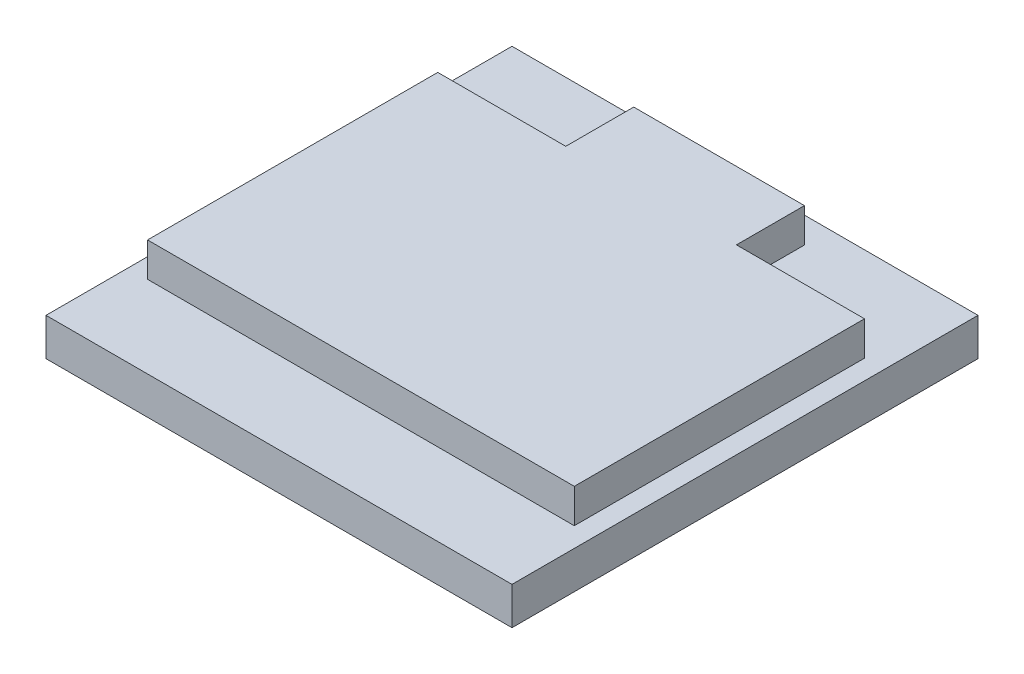
ISO-10303-21;
HEADER;
FILE_DESCRIPTION(('STEP AP214'),'2;1');
FILE_NAME('part.step','',(''),(''),'','','');
FILE_SCHEMA(('AUTOMOTIVE_DESIGN { 1 0 10303 214 1 1 1 1 }'));
ENDSEC;
DATA;
#1=APPLICATION_CONTEXT('core data for automotive mechanical design processes');
#2=APPLICATION_PROTOCOL_DEFINITION('international standard','automotive_design',2000,#1);
#3=PRODUCT_CONTEXT('',#1,'mechanical');
#4=PRODUCT('Part','Part','',(#3));
#5=PRODUCT_RELATED_PRODUCT_CATEGORY('part','',(#4));
#6=PRODUCT_DEFINITION_FORMATION('','',#4);
#7=PRODUCT_DEFINITION_CONTEXT('part definition',#1,'design');
#8=PRODUCT_DEFINITION('design','',#6,#7);
#9=PRODUCT_DEFINITION_SHAPE('','',#8);
#10=(LENGTH_UNIT() NAMED_UNIT(*) SI_UNIT(.MILLI.,.METRE.));
#11=(NAMED_UNIT(*) PLANE_ANGLE_UNIT() SI_UNIT($,.RADIAN.));
#12=(NAMED_UNIT(*) SI_UNIT($,.STERADIAN.) SOLID_ANGLE_UNIT());
#13=UNCERTAINTY_MEASURE_WITH_UNIT(LENGTH_MEASURE(1.E-05),#10,'distance_accuracy_value','');
#14=(GEOMETRIC_REPRESENTATION_CONTEXT(3) GLOBAL_UNCERTAINTY_ASSIGNED_CONTEXT((#13)) GLOBAL_UNIT_ASSIGNED_CONTEXT((#10,
#11,#12)) REPRESENTATION_CONTEXT('',''));
#15=CARTESIAN_POINT('',(0.,0.,0.));
#16=DIRECTION('',(0.,0.,1.));
#17=DIRECTION('',(1.,0.,0.));
#18=AXIS2_PLACEMENT_3D('',#15,#16,#17);
#19=CARTESIAN_POINT('',(13.65,2.2,13.65));
#20=DIRECTION('',(-1.,0.,0.));
#21=DIRECTION('',(0.,0.,1.));
#22=AXIS2_PLACEMENT_3D('',#19,#20,#21);
#23=PLANE('',#22);
#24=DIRECTION('',(0.,0.,-1.));
#25=VECTOR('',#24,1.);
#26=CARTESIAN_POINT('',(13.65,0.,13.65));
#27=LINE('',#26,#25);
#28=CARTESIAN_POINT('',(13.65,0.,13.65));
#29=VERTEX_POINT('',#28);
#30=CARTESIAN_POINT('',(13.65,0.,-13.65));
#31=VERTEX_POINT('',#30);
#32=EDGE_CURVE('E129',#29,#31,#27,.T.);
#33=ORIENTED_EDGE('',*,*,#32,.T.);
#34=DIRECTION('',(0.,-1.,0.));
#35=VECTOR('',#34,1.);
#36=CARTESIAN_POINT('',(13.65,2.2,-13.65));
#37=LINE('',#36,#35);
#38=CARTESIAN_POINT('',(13.65,2.2,-13.65));
#39=VERTEX_POINT('',#38);
#40=EDGE_CURVE('E11',#39,#31,#37,.T.);
#41=ORIENTED_EDGE('',*,*,#40,.F.);
#42=DIRECTION('',(0.,0.,-1.));
#43=VECTOR('',#42,1.);
#44=CARTESIAN_POINT('',(13.65,2.2,13.65));
#45=LINE('',#44,#43);
#46=CARTESIAN_POINT('',(13.65,2.2,13.65));
#47=VERTEX_POINT('',#46);
#48=EDGE_CURVE('E194',#47,#39,#45,.T.);
#49=ORIENTED_EDGE('',*,*,#48,.F.);
#50=DIRECTION('',(0.,-1.,0.));
#51=VECTOR('',#50,1.);
#52=CARTESIAN_POINT('',(13.65,2.2,13.65));
#53=LINE('',#52,#51);
#54=EDGE_CURVE('E204',#47,#29,#53,.T.);
#55=ORIENTED_EDGE('',*,*,#54,.T.);
#56=EDGE_LOOP('',(#33,#41,#49,#55));
#57=FACE_BOUND('',#56,.T.);
#58=ADVANCED_FACE('F35',(#57),#23,.F.);
#59=CARTESIAN_POINT('',(-13.65,2.2,-13.65));
#60=DIRECTION('',(0.,0.,1.));
#61=DIRECTION('',(1.,0.,0.));
#62=AXIS2_PLACEMENT_3D('',#59,#60,#61);
#63=PLANE('',#62);
#64=DIRECTION('',(-1.,0.,0.));
#65=VECTOR('',#64,1.);
#66=CARTESIAN_POINT('',(-13.65,0.,-13.65));
#67=LINE('',#66,#65);
#68=CARTESIAN_POINT('',(-13.65,0.,-13.65));
#69=VERTEX_POINT('',#68);
#70=EDGE_CURVE('E207',#31,#69,#67,.T.);
#71=ORIENTED_EDGE('',*,*,#70,.T.);
#72=DIRECTION('',(0.,-1.,0.));
#73=VECTOR('',#72,1.);
#74=CARTESIAN_POINT('',(-13.65,2.2,-13.65));
#75=LINE('',#74,#73);
#76=CARTESIAN_POINT('',(-13.65,2.2,-13.65));
#77=VERTEX_POINT('',#76);
#78=EDGE_CURVE('E42',#77,#69,#75,.T.);
#79=ORIENTED_EDGE('',*,*,#78,.F.);
#80=DIRECTION('',(-1.,0.,0.));
#81=VECTOR('',#80,1.);
#82=CARTESIAN_POINT('',(-13.65,2.2,-13.65));
#83=LINE('',#82,#81);
#84=EDGE_CURVE('E197',#39,#77,#83,.T.);
#85=ORIENTED_EDGE('',*,*,#84,.F.);
#86=ORIENTED_EDGE('',*,*,#40,.T.);
#87=EDGE_LOOP('',(#71,#79,#85,#86));
#88=FACE_BOUND('',#87,.T.);
#89=ADVANCED_FACE('F237',(#88),#63,.F.);
#90=CARTESIAN_POINT('',(-13.65,2.2,13.65));
#91=DIRECTION('',(1.,0.,0.));
#92=DIRECTION('',(0.,0.,-1.));
#93=AXIS2_PLACEMENT_3D('',#90,#91,#92);
#94=PLANE('',#93);
#95=DIRECTION('',(0.,0.,1.));
#96=VECTOR('',#95,1.);
#97=CARTESIAN_POINT('',(-13.65,0.,13.65));
#98=LINE('',#97,#96);
#99=CARTESIAN_POINT('',(-13.65,0.,13.65));
#100=VERTEX_POINT('',#99);
#101=EDGE_CURVE('E209',#69,#100,#98,.T.);
#102=ORIENTED_EDGE('',*,*,#101,.T.);
#103=DIRECTION('',(0.,-1.,0.));
#104=VECTOR('',#103,1.);
#105=CARTESIAN_POINT('',(-13.65,2.2,13.65));
#106=LINE('',#105,#104);
#107=CARTESIAN_POINT('',(-13.65,2.2,13.65));
#108=VERTEX_POINT('',#107);
#109=EDGE_CURVE('E214',#108,#100,#106,.T.);
#110=ORIENTED_EDGE('',*,*,#109,.F.);
#111=DIRECTION('',(0.,0.,1.));
#112=VECTOR('',#111,1.);
#113=CARTESIAN_POINT('',(-13.65,2.2,13.65));
#114=LINE('',#113,#112);
#115=EDGE_CURVE('E200',#77,#108,#114,.T.);
#116=ORIENTED_EDGE('',*,*,#115,.F.);
#117=ORIENTED_EDGE('',*,*,#78,.T.);
#118=EDGE_LOOP('',(#102,#110,#116,#117));
#119=FACE_BOUND('',#118,.T.);
#120=ADVANCED_FACE('F221',(#119),#94,.F.);
#121=CARTESIAN_POINT('',(-13.65,2.2,13.65));
#122=DIRECTION('',(0.,0.,-1.));
#123=DIRECTION('',(-1.,0.,0.));
#124=AXIS2_PLACEMENT_3D('',#121,#122,#123);
#125=PLANE('',#124);
#126=DIRECTION('',(1.,0.,0.));
#127=VECTOR('',#126,1.);
#128=CARTESIAN_POINT('',(-13.65,0.,13.65));
#129=LINE('',#128,#127);
#130=EDGE_CURVE('E198',#100,#29,#129,.T.);
#131=ORIENTED_EDGE('',*,*,#130,.T.);
#132=ORIENTED_EDGE('',*,*,#54,.F.);
#133=DIRECTION('',(1.,0.,0.));
#134=VECTOR('',#133,1.);
#135=CARTESIAN_POINT('',(-13.65,2.2,13.65));
#136=LINE('',#135,#134);
#137=EDGE_CURVE('E202',#108,#47,#136,.T.);
#138=ORIENTED_EDGE('',*,*,#137,.F.);
#139=ORIENTED_EDGE('',*,*,#109,.T.);
#140=EDGE_LOOP('',(#131,#132,#138,#139));
#141=FACE_BOUND('',#140,.T.);
#142=ADVANCED_FACE('F230',(#141),#125,.F.);
#143=CARTESIAN_POINT('',(0.,2.2,0.));
#144=DIRECTION('',(0.,-1.,0.));
#145=DIRECTION('',(0.,0.,-1.));
#146=AXIS2_PLACEMENT_3D('',#143,#144,#145);
#147=PLANE('',#146);
#148=DIRECTION('',(0.,0.,-1.));
#149=VECTOR('',#148,1.);
#150=CARTESIAN_POINT('',(5.,2.2,0.));
#151=LINE('',#150,#149);
#152=CARTESIAN_POINT('',(5.,2.2,-8.15));
#153=VERTEX_POINT('',#152);
#154=CARTESIAN_POINT('',(5.,2.2,-12.1321184583191));
#155=VERTEX_POINT('',#154);
#156=EDGE_CURVE('E169',#153,#155,#151,.T.);
#157=ORIENTED_EDGE('',*,*,#156,.F.);
#158=DIRECTION('',(1.,0.,0.));
#159=VECTOR('',#158,1.);
#160=CARTESIAN_POINT('',(0.,2.2,-8.15));
#161=LINE('',#160,#159);
#162=CARTESIAN_POINT('',(12.5,2.2,-8.15));
#163=VERTEX_POINT('',#162);
#164=EDGE_CURVE('E49',#153,#163,#161,.T.);
#165=ORIENTED_EDGE('',*,*,#164,.T.);
#166=DIRECTION('',(0.,0.,-1.));
#167=VECTOR('',#166,1.);
#168=CARTESIAN_POINT('',(12.5,2.2,0.));
#169=LINE('',#168,#167);
#170=CARTESIAN_POINT('',(12.5,2.2,8.85));
#171=VERTEX_POINT('',#170);
#172=EDGE_CURVE('E54',#171,#163,#169,.T.);
#173=ORIENTED_EDGE('',*,*,#172,.F.);
#174=DIRECTION('',(1.,0.,0.));
#175=VECTOR('',#174,1.);
#176=CARTESIAN_POINT('',(0.,2.2,8.85));
#177=LINE('',#176,#175);
#178=CARTESIAN_POINT('',(-12.5,2.2,8.85));
#179=VERTEX_POINT('',#178);
#180=EDGE_CURVE('E147',#179,#171,#177,.T.);
#181=ORIENTED_EDGE('',*,*,#180,.F.);
#182=DIRECTION('',(0.,0.,-1.));
#183=VECTOR('',#182,1.);
#184=CARTESIAN_POINT('',(-12.5,2.2,0.));
#185=LINE('',#184,#183);
#186=CARTESIAN_POINT('',(-12.5,2.2,-8.15));
#187=VERTEX_POINT('',#186);
#188=EDGE_CURVE('E176',#179,#187,#185,.T.);
#189=ORIENTED_EDGE('',*,*,#188,.T.);
#190=CARTESIAN_POINT('',(-5.,2.2,-8.15));
#191=VERTEX_POINT('',#190);
#192=EDGE_CURVE('E170',#187,#191,#161,.T.);
#193=ORIENTED_EDGE('',*,*,#192,.T.);
#194=DIRECTION('',(0.,0.,-1.));
#195=VECTOR('',#194,1.);
#196=CARTESIAN_POINT('',(-5.,2.2,0.));
#197=LINE('',#196,#195);
#198=CARTESIAN_POINT('',(-5.,2.2,-12.1321184583191));
#199=VERTEX_POINT('',#198);
#200=EDGE_CURVE('E174',#191,#199,#197,.T.);
#201=ORIENTED_EDGE('',*,*,#200,.T.);
#202=DIRECTION('',(1.,0.,0.));
#203=VECTOR('',#202,1.);
#204=CARTESIAN_POINT('',(0.,2.2,-12.1321184583191));
#205=LINE('',#204,#203);
#206=EDGE_CURVE('E172',#199,#155,#205,.T.);
#207=ORIENTED_EDGE('',*,*,#206,.T.);
#208=EDGE_LOOP('',(#157,#165,#173,#181,#189,#193,#201,#207));
#209=FACE_BOUND('',#208,.T.);
#210=ORIENTED_EDGE('',*,*,#48,.T.);
#211=ORIENTED_EDGE('',*,*,#84,.T.);
#212=ORIENTED_EDGE('',*,*,#115,.T.);
#213=ORIENTED_EDGE('',*,*,#137,.T.);
#214=EDGE_LOOP('',(#210,#211,#212,#213));
#215=FACE_BOUND('',#214,.T.);
#216=ADVANCED_FACE('F236',(#209,#215),#147,.F.);
#217=CARTESIAN_POINT('',(0.,0.,0.));
#218=DIRECTION('',(0.,-1.,0.));
#219=DIRECTION('',(0.,0.,-1.));
#220=AXIS2_PLACEMENT_3D('',#217,#218,#219);
#221=PLANE('',#220);
#222=ORIENTED_EDGE('',*,*,#32,.F.);
#223=ORIENTED_EDGE('',*,*,#130,.F.);
#224=ORIENTED_EDGE('',*,*,#101,.F.);
#225=ORIENTED_EDGE('',*,*,#70,.F.);
#226=EDGE_LOOP('',(#222,#223,#224,#225));
#227=FACE_BOUND('',#226,.T.);
#228=ADVANCED_FACE('F227',(#227),#221,.T.);
#229=CARTESIAN_POINT('',(0.,4.2,-8.15));
#230=DIRECTION('',(0.,0.,-1.));
#231=DIRECTION('',(-1.,0.,0.));
#232=AXIS2_PLACEMENT_3D('',#229,#230,#231);
#233=PLANE('',#232);
#234=ORIENTED_EDGE('',*,*,#164,.F.);
#235=DIRECTION('',(0.,-1.,0.));
#236=VECTOR('',#235,1.);
#237=CARTESIAN_POINT('',(5.,4.2,-8.15));
#238=LINE('',#237,#236);
#239=CARTESIAN_POINT('',(5.,4.2,-8.15));
#240=VERTEX_POINT('',#239);
#241=EDGE_CURVE('E122',#240,#153,#238,.T.);
#242=ORIENTED_EDGE('',*,*,#241,.F.);
#243=DIRECTION('',(1.,0.,0.));
#244=VECTOR('',#243,1.);
#245=CARTESIAN_POINT('',(0.,4.2,-8.15));
#246=LINE('',#245,#244);
#247=CARTESIAN_POINT('',(12.5,4.2,-8.15));
#248=VERTEX_POINT('',#247);
#249=EDGE_CURVE('E126',#240,#248,#246,.T.);
#250=ORIENTED_EDGE('',*,*,#249,.T.);
#251=DIRECTION('',(0.,-1.,0.));
#252=VECTOR('',#251,1.);
#253=CARTESIAN_POINT('',(12.5,4.2,-8.15));
#254=LINE('',#253,#252);
#255=EDGE_CURVE('E167',#248,#163,#254,.T.);
#256=ORIENTED_EDGE('',*,*,#255,.T.);
#257=EDGE_LOOP('',(#234,#242,#250,#256));
#258=FACE_BOUND('',#257,.T.);
#259=ADVANCED_FACE('F124',(#258),#233,.T.);
#260=CARTESIAN_POINT('',(5.,4.2,0.));
#261=DIRECTION('',(-1.,0.,0.));
#262=DIRECTION('',(0.,0.,1.));
#263=AXIS2_PLACEMENT_3D('',#260,#261,#262);
#264=PLANE('',#263);
#265=ORIENTED_EDGE('',*,*,#156,.T.);
#266=DIRECTION('',(0.,-1.,0.));
#267=VECTOR('',#266,1.);
#268=CARTESIAN_POINT('',(5.,4.2,-12.1321184583191));
#269=LINE('',#268,#267);
#270=CARTESIAN_POINT('',(5.,4.2,-12.1321184583191));
#271=VERTEX_POINT('',#270);
#272=EDGE_CURVE('E130',#271,#155,#269,.T.);
#273=ORIENTED_EDGE('',*,*,#272,.F.);
#274=DIRECTION('',(0.,0.,-1.));
#275=VECTOR('',#274,1.);
#276=CARTESIAN_POINT('',(5.,4.2,0.));
#277=LINE('',#276,#275);
#278=EDGE_CURVE('E133',#240,#271,#277,.T.);
#279=ORIENTED_EDGE('',*,*,#278,.F.);
#280=ORIENTED_EDGE('',*,*,#241,.T.);
#281=EDGE_LOOP('',(#265,#273,#279,#280));
#282=FACE_BOUND('',#281,.T.);
#283=ADVANCED_FACE('F134',(#282),#264,.F.);
#284=CARTESIAN_POINT('',(0.,4.2,-12.1321184583191));
#285=DIRECTION('',(0.,0.,-1.));
#286=DIRECTION('',(-1.,0.,0.));
#287=AXIS2_PLACEMENT_3D('',#284,#285,#286);
#288=PLANE('',#287);
#289=ORIENTED_EDGE('',*,*,#206,.F.);
#290=DIRECTION('',(0.,-1.,0.));
#291=VECTOR('',#290,1.);
#292=CARTESIAN_POINT('',(-5.,4.2,-12.1321184583191));
#293=LINE('',#292,#291);
#294=CARTESIAN_POINT('',(-5.,4.2,-12.1321184583191));
#295=VERTEX_POINT('',#294);
#296=EDGE_CURVE('E191',#295,#199,#293,.T.);
#297=ORIENTED_EDGE('',*,*,#296,.F.);
#298=DIRECTION('',(1.,0.,0.));
#299=VECTOR('',#298,1.);
#300=CARTESIAN_POINT('',(0.,4.2,-12.1321184583191));
#301=LINE('',#300,#299);
#302=EDGE_CURVE('E139',#295,#271,#301,.T.);
#303=ORIENTED_EDGE('',*,*,#302,.T.);
#304=ORIENTED_EDGE('',*,*,#272,.T.);
#305=EDGE_LOOP('',(#289,#297,#303,#304));
#306=FACE_BOUND('',#305,.T.);
#307=ADVANCED_FACE('F253',(#306),#288,.T.);
#308=CARTESIAN_POINT('',(-5.,4.2,0.));
#309=DIRECTION('',(-1.,0.,0.));
#310=DIRECTION('',(0.,0.,1.));
#311=AXIS2_PLACEMENT_3D('',#308,#309,#310);
#312=PLANE('',#311);
#313=ORIENTED_EDGE('',*,*,#200,.F.);
#314=DIRECTION('',(0.,-1.,0.));
#315=VECTOR('',#314,1.);
#316=CARTESIAN_POINT('',(-5.,4.2,-8.15));
#317=LINE('',#316,#315);
#318=CARTESIAN_POINT('',(-5.,4.2,-8.15));
#319=VERTEX_POINT('',#318);
#320=EDGE_CURVE('E189',#319,#191,#317,.T.);
#321=ORIENTED_EDGE('',*,*,#320,.F.);
#322=DIRECTION('',(0.,0.,-1.));
#323=VECTOR('',#322,1.);
#324=CARTESIAN_POINT('',(-5.,4.2,0.));
#325=LINE('',#324,#323);
#326=EDGE_CURVE('E151',#319,#295,#325,.T.);
#327=ORIENTED_EDGE('',*,*,#326,.T.);
#328=ORIENTED_EDGE('',*,*,#296,.T.);
#329=EDGE_LOOP('',(#313,#321,#327,#328));
#330=FACE_BOUND('',#329,.T.);
#331=ADVANCED_FACE('F256',(#330),#312,.T.);
#332=ORIENTED_EDGE('',*,*,#192,.F.);
#333=DIRECTION('',(0.,-1.,0.));
#334=VECTOR('',#333,1.);
#335=CARTESIAN_POINT('',(-12.5,4.2,-8.15));
#336=LINE('',#335,#334);
#337=CARTESIAN_POINT('',(-12.5,4.2,-8.15));
#338=VERTEX_POINT('',#337);
#339=EDGE_CURVE('E186',#338,#187,#336,.T.);
#340=ORIENTED_EDGE('',*,*,#339,.F.);
#341=EDGE_CURVE('E146',#338,#319,#246,.T.);
#342=ORIENTED_EDGE('',*,*,#341,.T.);
#343=ORIENTED_EDGE('',*,*,#320,.T.);
#344=EDGE_LOOP('',(#332,#340,#342,#343));
#345=FACE_BOUND('',#344,.T.);
#346=ADVANCED_FACE('F260',(#345),#233,.T.);
#347=CARTESIAN_POINT('',(-12.5,4.2,0.));
#348=DIRECTION('',(-1.,0.,0.));
#349=DIRECTION('',(0.,0.,1.));
#350=AXIS2_PLACEMENT_3D('',#347,#348,#349);
#351=PLANE('',#350);
#352=ORIENTED_EDGE('',*,*,#188,.F.);
#353=DIRECTION('',(0.,-1.,0.));
#354=VECTOR('',#353,1.);
#355=CARTESIAN_POINT('',(-12.5,4.2,8.85));
#356=LINE('',#355,#354);
#357=CARTESIAN_POINT('',(-12.5,4.2,8.85));
#358=VERTEX_POINT('',#357);
#359=EDGE_CURVE('E183',#358,#179,#356,.T.);
#360=ORIENTED_EDGE('',*,*,#359,.F.);
#361=DIRECTION('',(0.,0.,-1.));
#362=VECTOR('',#361,1.);
#363=CARTESIAN_POINT('',(-12.5,4.2,0.));
#364=LINE('',#363,#362);
#365=EDGE_CURVE('E150',#358,#338,#364,.T.);
#366=ORIENTED_EDGE('',*,*,#365,.T.);
#367=ORIENTED_EDGE('',*,*,#339,.T.);
#368=EDGE_LOOP('',(#352,#360,#366,#367));
#369=FACE_BOUND('',#368,.T.);
#370=ADVANCED_FACE('F263',(#369),#351,.T.);
#371=CARTESIAN_POINT('',(0.,4.2,8.85));
#372=DIRECTION('',(0.,0.,-1.));
#373=DIRECTION('',(-1.,0.,0.));
#374=AXIS2_PLACEMENT_3D('',#371,#372,#373);
#375=PLANE('',#374);
#376=ORIENTED_EDGE('',*,*,#180,.T.);
#377=DIRECTION('',(0.,-1.,0.));
#378=VECTOR('',#377,1.);
#379=CARTESIAN_POINT('',(12.5,4.2,8.85));
#380=LINE('',#379,#378);
#381=CARTESIAN_POINT('',(12.5,4.2,8.85));
#382=VERTEX_POINT('',#381);
#383=EDGE_CURVE('E180',#382,#171,#380,.T.);
#384=ORIENTED_EDGE('',*,*,#383,.F.);
#385=DIRECTION('',(1.,0.,0.));
#386=VECTOR('',#385,1.);
#387=CARTESIAN_POINT('',(0.,4.2,8.85));
#388=LINE('',#387,#386);
#389=EDGE_CURVE('E156',#358,#382,#388,.T.);
#390=ORIENTED_EDGE('',*,*,#389,.F.);
#391=ORIENTED_EDGE('',*,*,#359,.T.);
#392=EDGE_LOOP('',(#376,#384,#390,#391));
#393=FACE_BOUND('',#392,.T.);
#394=ADVANCED_FACE('F266',(#393),#375,.F.);
#395=CARTESIAN_POINT('',(12.5,4.2,0.));
#396=DIRECTION('',(-1.,0.,0.));
#397=DIRECTION('',(0.,0.,1.));
#398=AXIS2_PLACEMENT_3D('',#395,#396,#397);
#399=PLANE('',#398);
#400=ORIENTED_EDGE('',*,*,#172,.T.);
#401=ORIENTED_EDGE('',*,*,#255,.F.);
#402=DIRECTION('',(0.,0.,-1.));
#403=VECTOR('',#402,1.);
#404=CARTESIAN_POINT('',(12.5,4.2,0.));
#405=LINE('',#404,#403);
#406=EDGE_CURVE('E143',#382,#248,#405,.T.);
#407=ORIENTED_EDGE('',*,*,#406,.F.);
#408=ORIENTED_EDGE('',*,*,#383,.T.);
#409=EDGE_LOOP('',(#400,#401,#407,#408));
#410=FACE_BOUND('',#409,.T.);
#411=ADVANCED_FACE('F270',(#410),#399,.F.);
#412=CARTESIAN_POINT('',(0.,4.2,0.));
#413=DIRECTION('',(0.,1.,0.));
#414=DIRECTION('',(0.,0.,1.));
#415=AXIS2_PLACEMENT_3D('',#412,#413,#414);
#416=PLANE('',#415);
#417=ORIENTED_EDGE('',*,*,#249,.F.);
#418=ORIENTED_EDGE('',*,*,#278,.T.);
#419=ORIENTED_EDGE('',*,*,#302,.F.);
#420=ORIENTED_EDGE('',*,*,#326,.F.);
#421=ORIENTED_EDGE('',*,*,#341,.F.);
#422=ORIENTED_EDGE('',*,*,#365,.F.);
#423=ORIENTED_EDGE('',*,*,#389,.T.);
#424=ORIENTED_EDGE('',*,*,#406,.T.);
#425=EDGE_LOOP('',(#417,#418,#419,#420,#421,#422,#423,#424));
#426=FACE_BOUND('',#425,.T.);
#427=ADVANCED_FACE('F141',(#426),#416,.T.);
#428=CLOSED_SHELL('',(#58,#89,#120,#142,#216,#228,#259,#283,#307,#331,#346,#370,#394,#411,#427));
#429=MANIFOLD_SOLID_BREP('B2',#428);
#430=ADVANCED_BREP_SHAPE_REPRESENTATION('',(#18,#429),#14);
#431=SHAPE_DEFINITION_REPRESENTATION(#9,#430);
ENDSEC;
END-ISO-10303-21;
